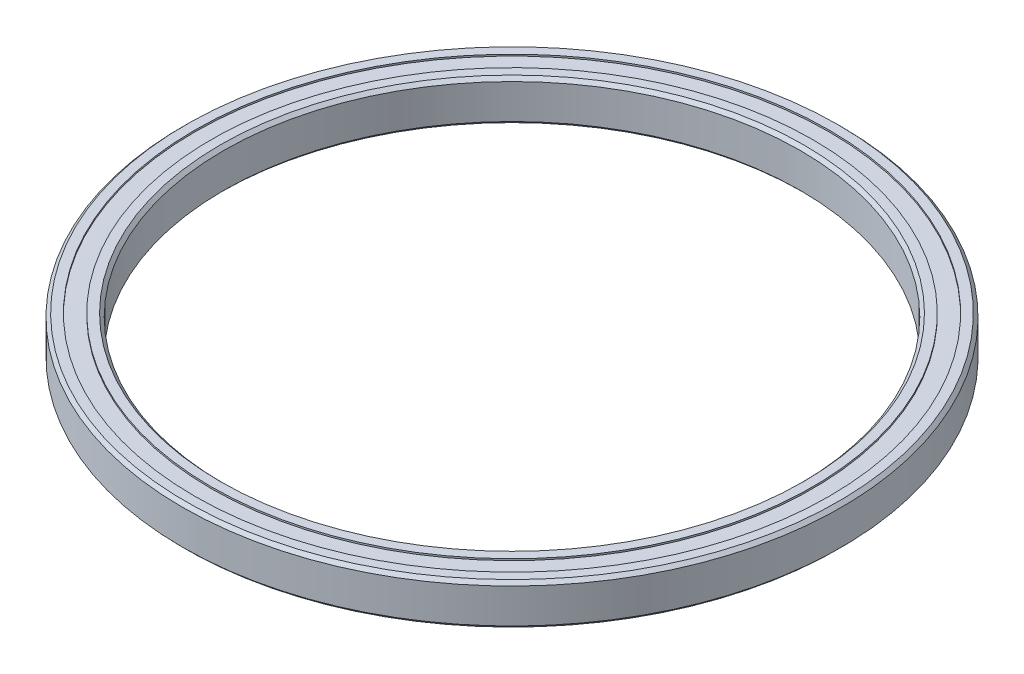
ISO-10303-21;
HEADER;
FILE_DESCRIPTION(('STEP AP214'),'2;1');
FILE_NAME('part.step','',(''),(''),'','','');
FILE_SCHEMA(('AUTOMOTIVE_DESIGN { 1 0 10303 214 1 1 1 1 }'));
ENDSEC;
DATA;
#1=APPLICATION_CONTEXT('core data for automotive mechanical design processes');
#2=APPLICATION_PROTOCOL_DEFINITION('international standard','automotive_design',2000,#1);
#3=PRODUCT_CONTEXT('',#1,'mechanical');
#4=PRODUCT('Part','Part','',(#3));
#5=PRODUCT_RELATED_PRODUCT_CATEGORY('part','',(#4));
#6=PRODUCT_DEFINITION_FORMATION('','',#4);
#7=PRODUCT_DEFINITION_CONTEXT('part definition',#1,'design');
#8=PRODUCT_DEFINITION('design','',#6,#7);
#9=PRODUCT_DEFINITION_SHAPE('','',#8);
#10=(LENGTH_UNIT() NAMED_UNIT(*) SI_UNIT(.MILLI.,.METRE.));
#11=(NAMED_UNIT(*) PLANE_ANGLE_UNIT() SI_UNIT($,.RADIAN.));
#12=(NAMED_UNIT(*) SI_UNIT($,.STERADIAN.) SOLID_ANGLE_UNIT());
#13=UNCERTAINTY_MEASURE_WITH_UNIT(LENGTH_MEASURE(1.E-05),#10,'distance_accuracy_value','');
#14=(GEOMETRIC_REPRESENTATION_CONTEXT(3) GLOBAL_UNCERTAINTY_ASSIGNED_CONTEXT((#13)) GLOBAL_UNIT_ASSIGNED_CONTEXT((#10,
#11,#12)) REPRESENTATION_CONTEXT('',''));
#15=CARTESIAN_POINT('',(0.,0.,0.));
#16=DIRECTION('',(0.,0.,1.));
#17=DIRECTION('',(1.,0.,0.));
#18=AXIS2_PLACEMENT_3D('',#15,#16,#17);
#19=CARTESIAN_POINT('',(-48.895,-3.175,0.));
#20=DIRECTION('',(0.,1.,0.));
#21=DIRECTION('',(1.,0.,0.));
#22=AXIS2_PLACEMENT_3D('',#19,#20,#21);
#23=PLANE('',#22);
#24=CARTESIAN_POINT('',(0.,-3.175,0.));
#25=DIRECTION('',(0.,-1.,0.));
#26=DIRECTION('',(0.,0.,-1.));
#27=AXIS2_PLACEMENT_3D('',#24,#25,#26);
#28=CIRCLE('',#27,48.895);
#29=CARTESIAN_POINT('',(0.,-3.175,-48.895));
#30=VERTEX_POINT('',#29);
#31=EDGE_CURVE('E65',#30,#30,#28,.T.);
#32=ORIENTED_EDGE('',*,*,#31,.F.);
#33=EDGE_LOOP('',(#32));
#34=FACE_BOUND('',#33,.T.);
#35=CARTESIAN_POINT('',(0.,-3.175,0.));
#36=DIRECTION('',(0.,-1.,0.));
#37=DIRECTION('',(0.,0.,-1.));
#38=AXIS2_PLACEMENT_3D('',#35,#36,#37);
#39=CIRCLE('',#38,50.292);
#40=CARTESIAN_POINT('',(0.,-3.175,-50.292));
#41=VERTEX_POINT('',#40);
#42=EDGE_CURVE('E73',#41,#41,#39,.T.);
#43=ORIENTED_EDGE('',*,*,#42,.T.);
#44=EDGE_LOOP('',(#43));
#45=FACE_BOUND('',#44,.T.);
#46=ADVANCED_FACE('F14',(#34,#45),#23,.F.);
#47=CARTESIAN_POINT('',(-46.355,-2.921,0.));
#48=DIRECTION('',(0.,1.,0.));
#49=DIRECTION('',(1.,0.,0.));
#50=AXIS2_PLACEMENT_3D('',#47,#48,#49);
#51=PLANE('',#50);
#52=CARTESIAN_POINT('',(0.,-2.921,0.));
#53=DIRECTION('',(0.,-1.,0.));
#54=DIRECTION('',(0.,0.,-1.));
#55=AXIS2_PLACEMENT_3D('',#52,#53,#54);
#56=CIRCLE('',#55,46.355);
#57=CARTESIAN_POINT('',(0.,-2.921,-46.355));
#58=VERTEX_POINT('',#57);
#59=EDGE_CURVE('E58',#58,#58,#56,.T.);
#60=ORIENTED_EDGE('',*,*,#59,.F.);
#61=EDGE_LOOP('',(#60));
#62=FACE_BOUND('',#61,.T.);
#63=CARTESIAN_POINT('',(0.,-2.921,0.));
#64=DIRECTION('',(0.,-1.,0.));
#65=DIRECTION('',(0.,0.,-1.));
#66=AXIS2_PLACEMENT_3D('',#63,#64,#65);
#67=CIRCLE('',#66,48.895);
#68=CARTESIAN_POINT('',(0.,-2.921,-48.895));
#69=VERTEX_POINT('',#68);
#70=EDGE_CURVE('E67',#69,#69,#67,.T.);
#71=ORIENTED_EDGE('',*,*,#70,.T.);
#72=EDGE_LOOP('',(#71));
#73=FACE_BOUND('',#72,.T.);
#74=ADVANCED_FACE('F114',(#62,#73),#51,.F.);
#75=CARTESIAN_POINT('',(-44.958,-3.175,0.));
#76=DIRECTION('',(0.,1.,0.));
#77=DIRECTION('',(1.,0.,0.));
#78=AXIS2_PLACEMENT_3D('',#75,#76,#77);
#79=PLANE('',#78);
#80=CARTESIAN_POINT('',(0.,-3.175,0.));
#81=DIRECTION('',(0.,-1.,0.));
#82=DIRECTION('',(0.,0.,-1.));
#83=AXIS2_PLACEMENT_3D('',#80,#81,#82);
#84=CIRCLE('',#83,44.958);
#85=CARTESIAN_POINT('',(0.,-3.175,-44.958));
#86=VERTEX_POINT('',#85);
#87=EDGE_CURVE('E54',#86,#86,#84,.T.);
#88=ORIENTED_EDGE('',*,*,#87,.F.);
#89=EDGE_LOOP('',(#88));
#90=FACE_BOUND('',#89,.T.);
#91=CARTESIAN_POINT('',(0.,-3.175,0.));
#92=DIRECTION('',(0.,-1.,0.));
#93=DIRECTION('',(0.,0.,-1.));
#94=AXIS2_PLACEMENT_3D('',#91,#92,#93);
#95=CIRCLE('',#94,46.355);
#96=CARTESIAN_POINT('',(0.,-3.175,-46.355));
#97=VERTEX_POINT('',#96);
#98=EDGE_CURVE('E63',#97,#97,#95,.T.);
#99=ORIENTED_EDGE('',*,*,#98,.T.);
#100=EDGE_LOOP('',(#99));
#101=FACE_BOUND('',#100,.T.);
#102=ADVANCED_FACE('F119',(#90,#101),#79,.F.);
#103=CARTESIAN_POINT('',(-46.355,3.175,0.));
#104=DIRECTION('',(0.,-1.,0.));
#105=DIRECTION('',(0.,0.,-1.));
#106=AXIS2_PLACEMENT_3D('',#103,#104,#105);
#107=PLANE('',#106);
#108=CARTESIAN_POINT('',(0.,3.175,0.));
#109=DIRECTION('',(0.,-1.,0.));
#110=DIRECTION('',(0.,0.,-1.));
#111=AXIS2_PLACEMENT_3D('',#108,#109,#110);
#112=CIRCLE('',#111,44.958);
#113=CARTESIAN_POINT('',(0.,3.175,-44.958));
#114=VERTEX_POINT('',#113);
#115=EDGE_CURVE('E50',#114,#114,#112,.T.);
#116=ORIENTED_EDGE('',*,*,#115,.T.);
#117=EDGE_LOOP('',(#116));
#118=FACE_BOUND('',#117,.T.);
#119=CARTESIAN_POINT('',(0.,3.175,0.));
#120=DIRECTION('',(0.,-1.,0.));
#121=DIRECTION('',(0.,0.,-1.));
#122=AXIS2_PLACEMENT_3D('',#119,#120,#121);
#123=CIRCLE('',#122,46.355);
#124=CARTESIAN_POINT('',(0.,3.175,-46.355));
#125=VERTEX_POINT('',#124);
#126=EDGE_CURVE('E43',#125,#125,#123,.T.);
#127=ORIENTED_EDGE('',*,*,#126,.F.);
#128=EDGE_LOOP('',(#127));
#129=FACE_BOUND('',#128,.T.);
#130=ADVANCED_FACE('F158',(#118,#129),#107,.F.);
#131=CARTESIAN_POINT('',(-48.895,2.921,0.));
#132=DIRECTION('',(0.,-1.,0.));
#133=DIRECTION('',(0.,0.,-1.));
#134=AXIS2_PLACEMENT_3D('',#131,#132,#133);
#135=PLANE('',#134);
#136=CARTESIAN_POINT('',(0.,2.921,0.));
#137=DIRECTION('',(0.,-1.,0.));
#138=DIRECTION('',(0.,0.,-1.));
#139=AXIS2_PLACEMENT_3D('',#136,#137,#138);
#140=CIRCLE('',#139,46.355);
#141=CARTESIAN_POINT('',(0.,2.921,-46.355));
#142=VERTEX_POINT('',#141);
#143=EDGE_CURVE('E40',#142,#142,#140,.T.);
#144=ORIENTED_EDGE('',*,*,#143,.T.);
#145=EDGE_LOOP('',(#144));
#146=FACE_BOUND('',#145,.T.);
#147=CARTESIAN_POINT('',(0.,2.921,0.));
#148=DIRECTION('',(0.,-1.,0.));
#149=DIRECTION('',(0.,0.,-1.));
#150=AXIS2_PLACEMENT_3D('',#147,#148,#149);
#151=CIRCLE('',#150,48.895);
#152=CARTESIAN_POINT('',(0.,2.921,-48.895));
#153=VERTEX_POINT('',#152);
#154=EDGE_CURVE('E21',#153,#153,#151,.T.);
#155=ORIENTED_EDGE('',*,*,#154,.F.);
#156=EDGE_LOOP('',(#155));
#157=FACE_BOUND('',#156,.T.);
#158=ADVANCED_FACE('F107',(#146,#157),#135,.F.);
#159=CARTESIAN_POINT('',(-50.292,3.175,0.));
#160=DIRECTION('',(0.,-1.,0.));
#161=DIRECTION('',(0.,0.,-1.));
#162=AXIS2_PLACEMENT_3D('',#159,#160,#161);
#163=PLANE('',#162);
#164=CARTESIAN_POINT('',(0.,3.175,0.));
#165=DIRECTION('',(0.,-1.,0.));
#166=DIRECTION('',(0.,0.,-1.));
#167=AXIS2_PLACEMENT_3D('',#164,#165,#166);
#168=CIRCLE('',#167,48.895);
#169=CARTESIAN_POINT('',(0.,3.175,-48.895));
#170=VERTEX_POINT('',#169);
#171=EDGE_CURVE('E28',#170,#170,#168,.T.);
#172=ORIENTED_EDGE('',*,*,#171,.T.);
#173=EDGE_LOOP('',(#172));
#174=FACE_BOUND('',#173,.T.);
#175=CARTESIAN_POINT('',(0.,3.175,0.));
#176=DIRECTION('',(0.,-1.,0.));
#177=DIRECTION('',(0.,0.,-1.));
#178=AXIS2_PLACEMENT_3D('',#175,#176,#177);
#179=CIRCLE('',#178,50.292);
#180=CARTESIAN_POINT('',(0.,3.175,-50.292));
#181=VERTEX_POINT('',#180);
#182=EDGE_CURVE('E10',#181,#181,#179,.T.);
#183=ORIENTED_EDGE('',*,*,#182,.F.);
#184=EDGE_LOOP('',(#183));
#185=FACE_BOUND('',#184,.T.);
#186=ADVANCED_FACE('F97',(#174,#185),#163,.F.);
#187=CARTESIAN_POINT('',(0.,3.175,0.));
#188=DIRECTION('',(0.,-1.,0.));
#189=DIRECTION('',(0.,0.,-1.));
#190=AXIS2_PLACEMENT_3D('',#187,#188,#189);
#191=CONICAL_SURFACE('',#190,50.292,0.785398163397459);
#192=CARTESIAN_POINT('',(0.,2.667,0.));
#193=DIRECTION('',(0.,-1.,0.));
#194=DIRECTION('',(0.,0.,-1.));
#195=AXIS2_PLACEMENT_3D('',#192,#193,#194);
#196=CIRCLE('',#195,50.8);
#197=CARTESIAN_POINT('',(0.,2.667,-50.8));
#198=VERTEX_POINT('',#197);
#199=EDGE_CURVE('E81',#198,#198,#196,.T.);
#200=ORIENTED_EDGE('',*,*,#199,.F.);
#201=EDGE_LOOP('',(#200));
#202=FACE_BOUND('',#201,.T.);
#203=ORIENTED_EDGE('',*,*,#182,.T.);
#204=EDGE_LOOP('',(#203));
#205=FACE_BOUND('',#204,.T.);
#206=ADVANCED_FACE('F96',(#202,#205),#191,.T.);
#207=CARTESIAN_POINT('',(0.,0.,0.));
#208=DIRECTION('',(0.,-1.,0.));
#209=DIRECTION('',(0.,0.,-1.));
#210=AXIS2_PLACEMENT_3D('',#207,#208,#209);
#211=CYLINDRICAL_SURFACE('',#210,48.895);
#212=ORIENTED_EDGE('',*,*,#154,.T.);
#213=EDGE_LOOP('',(#212));
#214=FACE_BOUND('',#213,.T.);
#215=ORIENTED_EDGE('',*,*,#171,.F.);
#216=EDGE_LOOP('',(#215));
#217=FACE_BOUND('',#216,.T.);
#218=ADVANCED_FACE('F98',(#214,#217),#211,.F.);
#219=CARTESIAN_POINT('',(0.,0.,0.));
#220=DIRECTION('',(0.,-1.,0.));
#221=DIRECTION('',(0.,0.,-1.));
#222=AXIS2_PLACEMENT_3D('',#219,#220,#221);
#223=CYLINDRICAL_SURFACE('',#222,46.355);
#224=ORIENTED_EDGE('',*,*,#143,.F.);
#225=EDGE_LOOP('',(#224));
#226=FACE_BOUND('',#225,.T.);
#227=ORIENTED_EDGE('',*,*,#126,.T.);
#228=EDGE_LOOP('',(#227));
#229=FACE_BOUND('',#228,.T.);
#230=ADVANCED_FACE('F106',(#226,#229),#223,.T.);
#231=CARTESIAN_POINT('',(0.,2.667,0.));
#232=DIRECTION('',(0.,1.,0.));
#233=DIRECTION('',(0.,0.,1.));
#234=AXIS2_PLACEMENT_3D('',#231,#232,#233);
#235=CONICAL_SURFACE('',#234,44.45,0.785398163397448);
#236=ORIENTED_EDGE('',*,*,#115,.F.);
#237=EDGE_LOOP('',(#236));
#238=FACE_BOUND('',#237,.T.);
#239=CARTESIAN_POINT('',(0.,2.667,0.));
#240=DIRECTION('',(0.,-1.,0.));
#241=DIRECTION('',(0.,0.,-1.));
#242=AXIS2_PLACEMENT_3D('',#239,#240,#241);
#243=CIRCLE('',#242,44.45);
#244=CARTESIAN_POINT('',(0.,2.667,-44.45));
#245=VERTEX_POINT('',#244);
#246=EDGE_CURVE('E51',#245,#245,#243,.T.);
#247=ORIENTED_EDGE('',*,*,#246,.T.);
#248=EDGE_LOOP('',(#247));
#249=FACE_BOUND('',#248,.T.);
#250=ADVANCED_FACE('F148',(#238,#249),#235,.F.);
#251=CARTESIAN_POINT('',(0.,0.,0.));
#252=DIRECTION('',(0.,-1.,0.));
#253=DIRECTION('',(0.,0.,-1.));
#254=AXIS2_PLACEMENT_3D('',#251,#252,#253);
#255=CYLINDRICAL_SURFACE('',#254,44.45);
#256=CARTESIAN_POINT('',(0.,-2.667,0.));
#257=DIRECTION('',(0.,-1.,0.));
#258=DIRECTION('',(0.,0.,-1.));
#259=AXIS2_PLACEMENT_3D('',#256,#257,#258);
#260=CIRCLE('',#259,44.45);
#261=CARTESIAN_POINT('',(0.,-2.667,-44.45));
#262=VERTEX_POINT('',#261);
#263=EDGE_CURVE('E56',#262,#262,#260,.T.);
#264=ORIENTED_EDGE('',*,*,#263,.T.);
#265=EDGE_LOOP('',(#264));
#266=FACE_BOUND('',#265,.T.);
#267=ORIENTED_EDGE('',*,*,#246,.F.);
#268=EDGE_LOOP('',(#267));
#269=FACE_BOUND('',#268,.T.);
#270=ADVANCED_FACE('F147',(#266,#269),#255,.F.);
#271=CARTESIAN_POINT('',(0.,-3.175,0.));
#272=DIRECTION('',(0.,-1.,0.));
#273=DIRECTION('',(0.,0.,-1.));
#274=AXIS2_PLACEMENT_3D('',#271,#272,#273);
#275=CONICAL_SURFACE('',#274,44.958,0.785398163397445);
#276=ORIENTED_EDGE('',*,*,#87,.T.);
#277=EDGE_LOOP('',(#276));
#278=FACE_BOUND('',#277,.T.);
#279=ORIENTED_EDGE('',*,*,#263,.F.);
#280=EDGE_LOOP('',(#279));
#281=FACE_BOUND('',#280,.T.);
#282=ADVANCED_FACE('F143',(#278,#281),#275,.F.);
#283=CARTESIAN_POINT('',(0.,0.,0.));
#284=DIRECTION('',(0.,-1.,0.));
#285=DIRECTION('',(0.,0.,-1.));
#286=AXIS2_PLACEMENT_3D('',#283,#284,#285);
#287=CYLINDRICAL_SURFACE('',#286,46.355);
#288=ORIENTED_EDGE('',*,*,#98,.F.);
#289=EDGE_LOOP('',(#288));
#290=FACE_BOUND('',#289,.T.);
#291=ORIENTED_EDGE('',*,*,#59,.T.);
#292=EDGE_LOOP('',(#291));
#293=FACE_BOUND('',#292,.T.);
#294=ADVANCED_FACE('F134',(#290,#293),#287,.T.);
#295=CARTESIAN_POINT('',(0.,0.,0.));
#296=DIRECTION('',(0.,-1.,0.));
#297=DIRECTION('',(0.,0.,-1.));
#298=AXIS2_PLACEMENT_3D('',#295,#296,#297);
#299=CYLINDRICAL_SURFACE('',#298,48.895);
#300=ORIENTED_EDGE('',*,*,#31,.T.);
#301=EDGE_LOOP('',(#300));
#302=FACE_BOUND('',#301,.T.);
#303=ORIENTED_EDGE('',*,*,#70,.F.);
#304=EDGE_LOOP('',(#303));
#305=FACE_BOUND('',#304,.T.);
#306=ADVANCED_FACE('F130',(#302,#305),#299,.F.);
#307=CARTESIAN_POINT('',(0.,-2.667,0.));
#308=DIRECTION('',(0.,1.,0.));
#309=DIRECTION('',(0.,0.,1.));
#310=AXIS2_PLACEMENT_3D('',#307,#308,#309);
#311=CONICAL_SURFACE('',#310,50.8,0.785398163397446);
#312=CARTESIAN_POINT('',(0.,-2.667,0.));
#313=DIRECTION('',(0.,-1.,0.));
#314=DIRECTION('',(0.,0.,-1.));
#315=AXIS2_PLACEMENT_3D('',#312,#313,#314);
#316=CIRCLE('',#315,50.8);
#317=CARTESIAN_POINT('',(0.,-2.667,-50.8));
#318=VERTEX_POINT('',#317);
#319=EDGE_CURVE('E80',#318,#318,#316,.T.);
#320=ORIENTED_EDGE('',*,*,#319,.T.);
#321=EDGE_LOOP('',(#320));
#322=FACE_BOUND('',#321,.T.);
#323=ORIENTED_EDGE('',*,*,#42,.F.);
#324=EDGE_LOOP('',(#323));
#325=FACE_BOUND('',#324,.T.);
#326=ADVANCED_FACE('F122',(#322,#325),#311,.T.);
#327=CARTESIAN_POINT('',(0.,0.,0.));
#328=DIRECTION('',(0.,-1.,0.));
#329=DIRECTION('',(0.,0.,-1.));
#330=AXIS2_PLACEMENT_3D('',#327,#328,#329);
#331=CYLINDRICAL_SURFACE('',#330,50.8);
#332=ORIENTED_EDGE('',*,*,#319,.F.);
#333=EDGE_LOOP('',(#332));
#334=FACE_BOUND('',#333,.T.);
#335=ORIENTED_EDGE('',*,*,#199,.T.);
#336=EDGE_LOOP('',(#335));
#337=FACE_BOUND('',#336,.T.);
#338=ADVANCED_FACE('F94',(#334,#337),#331,.T.);
#339=CLOSED_SHELL('',(#46,#74,#102,#130,#158,#186,#206,#218,#230,#250,#270,#282,#294,#306,#326,#338));
#340=MANIFOLD_SOLID_BREP('B1',#339);
#341=ADVANCED_BREP_SHAPE_REPRESENTATION('',(#18,#340),#14);
#342=SHAPE_DEFINITION_REPRESENTATION(#9,#341);
ENDSEC;
END-ISO-10303-21;
